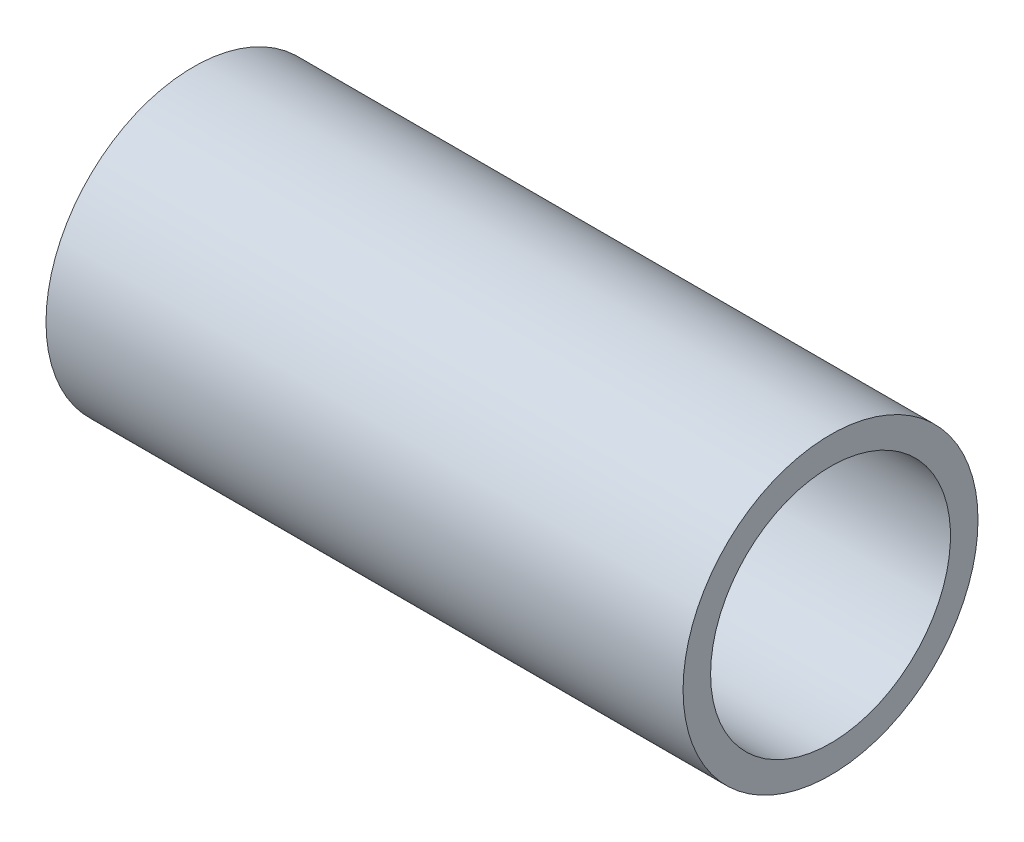
ISO-10303-21;
HEADER;
FILE_DESCRIPTION(('STEP AP214'),'2;1');
FILE_NAME('part.step','',(''),(''),'','','');
FILE_SCHEMA(('AUTOMOTIVE_DESIGN { 1 0 10303 214 1 1 1 1 }'));
ENDSEC;
DATA;
#1=APPLICATION_CONTEXT('core data for automotive mechanical design processes');
#2=APPLICATION_PROTOCOL_DEFINITION('international standard','automotive_design',2000,#1);
#3=PRODUCT_CONTEXT('',#1,'mechanical');
#4=PRODUCT('Part','Part','',(#3));
#5=PRODUCT_RELATED_PRODUCT_CATEGORY('part','',(#4));
#6=PRODUCT_DEFINITION_FORMATION('','',#4);
#7=PRODUCT_DEFINITION_CONTEXT('part definition',#1,'design');
#8=PRODUCT_DEFINITION('design','',#6,#7);
#9=PRODUCT_DEFINITION_SHAPE('','',#8);
#10=(LENGTH_UNIT() NAMED_UNIT(*) SI_UNIT(.MILLI.,.METRE.));
#11=(NAMED_UNIT(*) PLANE_ANGLE_UNIT() SI_UNIT($,.RADIAN.));
#12=(NAMED_UNIT(*) SI_UNIT($,.STERADIAN.) SOLID_ANGLE_UNIT());
#13=UNCERTAINTY_MEASURE_WITH_UNIT(LENGTH_MEASURE(1.E-05),#10,'distance_accuracy_value','');
#14=(GEOMETRIC_REPRESENTATION_CONTEXT(3) GLOBAL_UNCERTAINTY_ASSIGNED_CONTEXT((#13)) GLOBAL_UNIT_ASSIGNED_CONTEXT((#10,
#11,#12)) REPRESENTATION_CONTEXT('',''));
#15=CARTESIAN_POINT('',(0.,0.,0.));
#16=DIRECTION('',(0.,0.,1.));
#17=DIRECTION('',(1.,0.,0.));
#18=AXIS2_PLACEMENT_3D('',#15,#16,#17);
#19=CARTESIAN_POINT('',(-81.,37.5,0.));
#20=DIRECTION('',(1.,0.,0.));
#21=DIRECTION('',(0.,0.,-1.));
#22=AXIS2_PLACEMENT_3D('',#19,#20,#21);
#23=PLANE('',#22);
#24=CARTESIAN_POINT('',(-81.,0.,0.));
#25=DIRECTION('',(-1.,0.,0.));
#26=DIRECTION('',(0.,0.,1.));
#27=AXIS2_PLACEMENT_3D('',#24,#25,#26);
#28=CIRCLE('',#27,30.5);
#29=CARTESIAN_POINT('',(-81.,0.,30.5));
#30=VERTEX_POINT('',#29);
#31=EDGE_CURVE('E51',#30,#30,#28,.T.);
#32=ORIENTED_EDGE('',*,*,#31,.F.);
#33=EDGE_LOOP('',(#32));
#34=FACE_BOUND('',#33,.T.);
#35=CARTESIAN_POINT('',(-81.,0.,0.));
#36=DIRECTION('',(-1.,0.,0.));
#37=DIRECTION('',(0.,0.,1.));
#38=AXIS2_PLACEMENT_3D('',#35,#36,#37);
#39=CIRCLE('',#38,37.5);
#40=CARTESIAN_POINT('',(-81.,0.,37.5));
#41=VERTEX_POINT('',#40);
#42=EDGE_CURVE('E10',#41,#41,#39,.T.);
#43=ORIENTED_EDGE('',*,*,#42,.T.);
#44=EDGE_LOOP('',(#43));
#45=FACE_BOUND('',#44,.T.);
#46=ADVANCED_FACE('F37',(#34,#45),#23,.F.);
#47=CARTESIAN_POINT('',(0.,0.,0.));
#48=DIRECTION('',(-1.,0.,0.));
#49=DIRECTION('',(0.,0.,1.));
#50=AXIS2_PLACEMENT_3D('',#47,#48,#49);
#51=CYLINDRICAL_SURFACE('',#50,37.5);
#52=ORIENTED_EDGE('',*,*,#42,.F.);
#53=EDGE_LOOP('',(#52));
#54=FACE_BOUND('',#53,.T.);
#55=CARTESIAN_POINT('',(81.,0.,0.));
#56=DIRECTION('',(-1.,0.,0.));
#57=DIRECTION('',(0.,0.,1.));
#58=AXIS2_PLACEMENT_3D('',#55,#56,#57);
#59=CIRCLE('',#58,37.5);
#60=CARTESIAN_POINT('',(81.,0.,37.5));
#61=VERTEX_POINT('',#60);
#62=EDGE_CURVE('E43',#61,#61,#59,.T.);
#63=ORIENTED_EDGE('',*,*,#62,.T.);
#64=EDGE_LOOP('',(#63));
#65=FACE_BOUND('',#64,.T.);
#66=ADVANCED_FACE('F60',(#54,#65),#51,.T.);
#67=CARTESIAN_POINT('',(81.,37.5,0.));
#68=DIRECTION('',(-1.,0.,0.));
#69=DIRECTION('',(0.,0.,1.));
#70=AXIS2_PLACEMENT_3D('',#67,#68,#69);
#71=PLANE('',#70);
#72=ORIENTED_EDGE('',*,*,#62,.F.);
#73=EDGE_LOOP('',(#72));
#74=FACE_BOUND('',#73,.T.);
#75=CARTESIAN_POINT('',(81.,0.,0.));
#76=DIRECTION('',(-1.,0.,0.));
#77=DIRECTION('',(0.,0.,1.));
#78=AXIS2_PLACEMENT_3D('',#75,#76,#77);
#79=CIRCLE('',#78,30.5);
#80=CARTESIAN_POINT('',(81.,0.,30.5));
#81=VERTEX_POINT('',#80);
#82=EDGE_CURVE('E47',#81,#81,#79,.T.);
#83=ORIENTED_EDGE('',*,*,#82,.T.);
#84=EDGE_LOOP('',(#83));
#85=FACE_BOUND('',#84,.T.);
#86=ADVANCED_FACE('F64',(#74,#85),#71,.F.);
#87=CARTESIAN_POINT('',(0.,0.,0.));
#88=DIRECTION('',(-1.,0.,0.));
#89=DIRECTION('',(0.,0.,1.));
#90=AXIS2_PLACEMENT_3D('',#87,#88,#89);
#91=CYLINDRICAL_SURFACE('',#90,30.5);
#92=ORIENTED_EDGE('',*,*,#82,.F.);
#93=EDGE_LOOP('',(#92));
#94=FACE_BOUND('',#93,.T.);
#95=ORIENTED_EDGE('',*,*,#31,.T.);
#96=EDGE_LOOP('',(#95));
#97=FACE_BOUND('',#96,.T.);
#98=ADVANCED_FACE('F57',(#94,#97),#91,.F.);
#99=CLOSED_SHELL('',(#46,#66,#86,#98));
#100=MANIFOLD_SOLID_BREP('B2',#99);
#101=ADVANCED_BREP_SHAPE_REPRESENTATION('',(#18,#100),#14);
#102=SHAPE_DEFINITION_REPRESENTATION(#9,#101);
ENDSEC;
END-ISO-10303-21;
